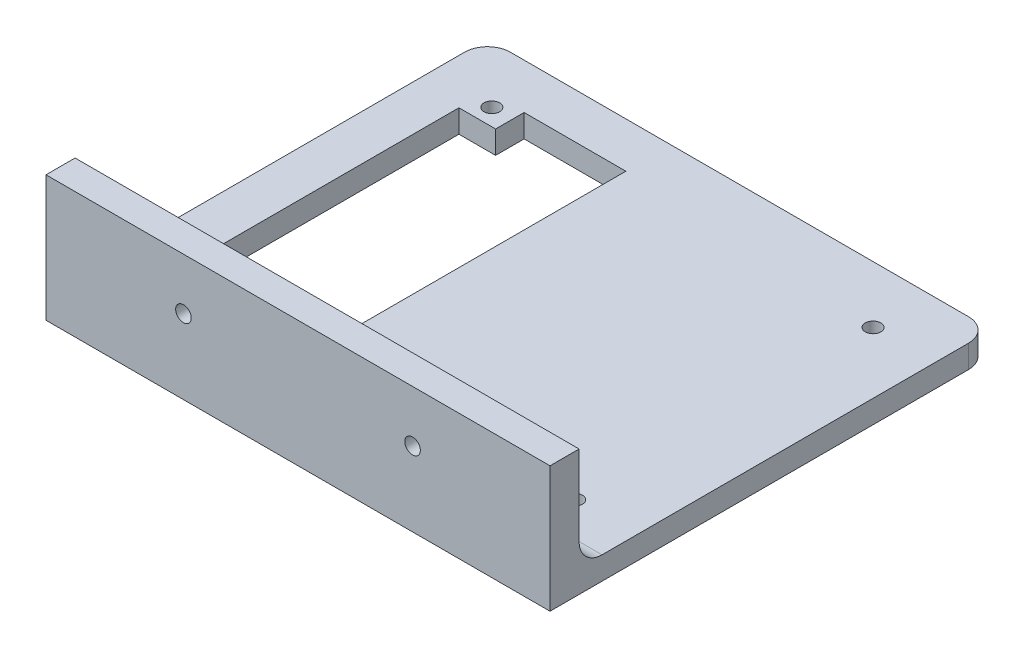
ISO-10303-21;
HEADER;
FILE_DESCRIPTION(('STEP AP214'),'2;1');
FILE_NAME('part.step','',(''),(''),'','','');
FILE_SCHEMA(('AUTOMOTIVE_DESIGN { 1 0 10303 214 1 1 1 1 }'));
ENDSEC;
DATA;
#1=APPLICATION_CONTEXT('core data for automotive mechanical design processes');
#2=APPLICATION_PROTOCOL_DEFINITION('international standard','automotive_design',2000,#1);
#3=PRODUCT_CONTEXT('',#1,'mechanical');
#4=PRODUCT('Part','Part','',(#3));
#5=PRODUCT_RELATED_PRODUCT_CATEGORY('part','',(#4));
#6=PRODUCT_DEFINITION_FORMATION('','',#4);
#7=PRODUCT_DEFINITION_CONTEXT('part definition',#1,'design');
#8=PRODUCT_DEFINITION('design','',#6,#7);
#9=PRODUCT_DEFINITION_SHAPE('','',#8);
#10=(LENGTH_UNIT() NAMED_UNIT(*) SI_UNIT(.MILLI.,.METRE.));
#11=(NAMED_UNIT(*) PLANE_ANGLE_UNIT() SI_UNIT($,.RADIAN.));
#12=(NAMED_UNIT(*) SI_UNIT($,.STERADIAN.) SOLID_ANGLE_UNIT());
#13=UNCERTAINTY_MEASURE_WITH_UNIT(LENGTH_MEASURE(1.E-05),#10,'distance_accuracy_value','');
#14=(GEOMETRIC_REPRESENTATION_CONTEXT(3) GLOBAL_UNCERTAINTY_ASSIGNED_CONTEXT((#13)) GLOBAL_UNIT_ASSIGNED_CONTEXT((#10,
#11,#12)) REPRESENTATION_CONTEXT('',''));
#15=CARTESIAN_POINT('',(0.,0.,0.));
#16=DIRECTION('',(0.,0.,1.));
#17=DIRECTION('',(1.,0.,0.));
#18=AXIS2_PLACEMENT_3D('',#15,#16,#17);
#19=CARTESIAN_POINT('',(0.,2.5,0.));
#20=DIRECTION('',(1.,0.,0.));
#21=DIRECTION('',(0.,0.,-1.));
#22=AXIS2_PLACEMENT_3D('',#19,#20,#21);
#23=PLANE('',#22);
#24=DIRECTION('',(0.,0.,1.));
#25=VECTOR('',#24,1.);
#26=CARTESIAN_POINT('',(0.,2.5,0.));
#27=LINE('',#26,#25);
#28=CARTESIAN_POINT('',(0.,2.5,5.));
#29=VERTEX_POINT('',#28);
#30=CARTESIAN_POINT('',(0.,2.5,85.));
#31=VERTEX_POINT('',#30);
#32=EDGE_CURVE('E296',#29,#31,#27,.T.);
#33=ORIENTED_EDGE('',*,*,#32,.F.);
#34=DIRECTION('',(0.,-1.,0.));
#35=VECTOR('',#34,1.);
#36=CARTESIAN_POINT('',(0.,2.5,5.));
#37=LINE('',#36,#35);
#38=CARTESIAN_POINT('',(0.,-2.5,5.));
#39=VERTEX_POINT('',#38);
#40=EDGE_CURVE('E327',#29,#39,#37,.T.);
#41=ORIENTED_EDGE('',*,*,#40,.T.);
#42=DIRECTION('',(0.,0.,1.));
#43=VECTOR('',#42,1.);
#44=CARTESIAN_POINT('',(0.,-2.5,0.));
#45=LINE('',#44,#43);
#46=CARTESIAN_POINT('',(0.,-2.5,96.35));
#47=VERTEX_POINT('',#46);
#48=EDGE_CURVE('E295',#39,#47,#45,.T.);
#49=ORIENTED_EDGE('',*,*,#48,.T.);
#50=DIRECTION('',(0.,1.,0.));
#51=VECTOR('',#50,1.);
#52=CARTESIAN_POINT('',(0.,-112.683131649087,96.35));
#53=LINE('',#52,#51);
#54=CARTESIAN_POINT('',(0.,25.,96.35));
#55=VERTEX_POINT('',#54);
#56=EDGE_CURVE('E260',#47,#55,#53,.T.);
#57=ORIENTED_EDGE('',*,*,#56,.T.);
#58=DIRECTION('',(0.,0.,1.));
#59=VECTOR('',#58,1.);
#60=CARTESIAN_POINT('',(0.,25.,90.));
#61=LINE('',#60,#59);
#62=CARTESIAN_POINT('',(0.,25.,90.));
#63=VERTEX_POINT('',#62);
#64=EDGE_CURVE('E248',#63,#55,#61,.T.);
#65=ORIENTED_EDGE('',*,*,#64,.F.);
#66=DIRECTION('',(0.,1.,0.));
#67=VECTOR('',#66,1.);
#68=CARTESIAN_POINT('',(0.,-112.683131649087,90.));
#69=LINE('',#68,#67);
#70=CARTESIAN_POINT('',(0.,7.50000000000001,90.));
#71=VERTEX_POINT('',#70);
#72=EDGE_CURVE('E261',#71,#63,#69,.T.);
#73=ORIENTED_EDGE('',*,*,#72,.F.);
#74=CARTESIAN_POINT('',(0.,7.5,85.));
#75=DIRECTION('',(1.,0.,0.));
#76=DIRECTION('',(0.,0.,-1.));
#77=AXIS2_PLACEMENT_3D('',#74,#75,#76);
#78=CIRCLE('',#77,5.);
#79=EDGE_CURVE('E11',#71,#31,#78,.T.);
#80=ORIENTED_EDGE('',*,*,#79,.T.);
#81=EDGE_LOOP('',(#33,#41,#49,#57,#65,#73,#80));
#82=FACE_BOUND('',#81,.T.);
#83=ADVANCED_FACE('F39',(#82),#23,.F.);
#84=CARTESIAN_POINT('',(110.,2.5,0.));
#85=DIRECTION('',(-1.,0.,0.));
#86=DIRECTION('',(0.,0.,1.));
#87=AXIS2_PLACEMENT_3D('',#84,#85,#86);
#88=PLANE('',#87);
#89=DIRECTION('',(0.,0.,-1.));
#90=VECTOR('',#89,1.);
#91=CARTESIAN_POINT('',(110.,-2.5,0.));
#92=LINE('',#91,#90);
#93=CARTESIAN_POINT('',(110.,-2.5,96.35));
#94=VERTEX_POINT('',#93);
#95=CARTESIAN_POINT('',(110.,-2.5,5.));
#96=VERTEX_POINT('',#95);
#97=EDGE_CURVE('E307',#94,#96,#92,.T.);
#98=ORIENTED_EDGE('',*,*,#97,.T.);
#99=DIRECTION('',(0.,-1.,0.));
#100=VECTOR('',#99,1.);
#101=CARTESIAN_POINT('',(110.,2.5,5.));
#102=LINE('',#101,#100);
#103=CARTESIAN_POINT('',(110.,2.5,5.));
#104=VERTEX_POINT('',#103);
#105=EDGE_CURVE('E320',#96,#104,#102,.F.);
#106=ORIENTED_EDGE('',*,*,#105,.T.);
#107=DIRECTION('',(0.,0.,-1.));
#108=VECTOR('',#107,1.);
#109=CARTESIAN_POINT('',(110.,2.5,0.));
#110=LINE('',#109,#108);
#111=CARTESIAN_POINT('',(110.,2.5,85.));
#112=VERTEX_POINT('',#111);
#113=EDGE_CURVE('E299',#112,#104,#110,.T.);
#114=ORIENTED_EDGE('',*,*,#113,.F.);
#115=CARTESIAN_POINT('',(110.,7.5,85.));
#116=DIRECTION('',(-1.,0.,0.));
#117=DIRECTION('',(0.,0.,1.));
#118=AXIS2_PLACEMENT_3D('',#115,#116,#117);
#119=CIRCLE('',#118,5.);
#120=CARTESIAN_POINT('',(110.,7.50000000000001,90.));
#121=VERTEX_POINT('',#120);
#122=EDGE_CURVE('E47',#112,#121,#119,.T.);
#123=ORIENTED_EDGE('',*,*,#122,.T.);
#124=DIRECTION('',(0.,1.,0.));
#125=VECTOR('',#124,1.);
#126=CARTESIAN_POINT('',(110.,-112.683131649087,90.));
#127=LINE('',#126,#125);
#128=CARTESIAN_POINT('',(110.,25.,90.));
#129=VERTEX_POINT('',#128);
#130=EDGE_CURVE('E264',#121,#129,#127,.T.);
#131=ORIENTED_EDGE('',*,*,#130,.T.);
#132=DIRECTION('',(0.,0.,-1.));
#133=VECTOR('',#132,1.);
#134=CARTESIAN_POINT('',(110.,25.,90.));
#135=LINE('',#134,#133);
#136=CARTESIAN_POINT('',(110.,25.,96.35));
#137=VERTEX_POINT('',#136);
#138=EDGE_CURVE('E254',#137,#129,#135,.T.);
#139=ORIENTED_EDGE('',*,*,#138,.F.);
#140=DIRECTION('',(0.,1.,0.));
#141=VECTOR('',#140,1.);
#142=CARTESIAN_POINT('',(110.,-112.683131649087,96.35));
#143=LINE('',#142,#141);
#144=EDGE_CURVE('E266',#94,#137,#143,.T.);
#145=ORIENTED_EDGE('',*,*,#144,.F.);
#146=EDGE_LOOP('',(#98,#106,#114,#123,#131,#139,#145));
#147=FACE_BOUND('',#146,.T.);
#148=ADVANCED_FACE('F339',(#147),#88,.F.);
#149=CARTESIAN_POINT('',(0.,2.5,0.));
#150=DIRECTION('',(0.,0.,1.));
#151=DIRECTION('',(1.,0.,0.));
#152=AXIS2_PLACEMENT_3D('',#149,#150,#151);
#153=PLANE('',#152);
#154=DIRECTION('',(-1.,0.,0.));
#155=VECTOR('',#154,1.);
#156=CARTESIAN_POINT('',(0.,2.5,0.));
#157=LINE('',#156,#155);
#158=CARTESIAN_POINT('',(105.,2.5,0.));
#159=VERTEX_POINT('',#158);
#160=CARTESIAN_POINT('',(5.,2.5,0.));
#161=VERTEX_POINT('',#160);
#162=EDGE_CURVE('E302',#159,#161,#157,.T.);
#163=ORIENTED_EDGE('',*,*,#162,.F.);
#164=DIRECTION('',(0.,-1.,0.));
#165=VECTOR('',#164,1.);
#166=CARTESIAN_POINT('',(105.,2.5,0.));
#167=LINE('',#166,#165);
#168=CARTESIAN_POINT('',(105.,-2.5,0.));
#169=VERTEX_POINT('',#168);
#170=EDGE_CURVE('E313',#159,#169,#167,.T.);
#171=ORIENTED_EDGE('',*,*,#170,.T.);
#172=DIRECTION('',(-1.,0.,0.));
#173=VECTOR('',#172,1.);
#174=CARTESIAN_POINT('',(0.,-2.5,0.));
#175=LINE('',#174,#173);
#176=CARTESIAN_POINT('',(5.,-2.5,0.));
#177=VERTEX_POINT('',#176);
#178=EDGE_CURVE('E300',#169,#177,#175,.T.);
#179=ORIENTED_EDGE('',*,*,#178,.T.);
#180=DIRECTION('',(0.,-1.,0.));
#181=VECTOR('',#180,1.);
#182=CARTESIAN_POINT('',(5.,2.5,0.));
#183=LINE('',#182,#181);
#184=EDGE_CURVE('E305',#177,#161,#183,.F.);
#185=ORIENTED_EDGE('',*,*,#184,.T.);
#186=EDGE_LOOP('',(#163,#171,#179,#185));
#187=FACE_BOUND('',#186,.T.);
#188=ADVANCED_FACE('F349',(#187),#153,.F.);
#189=CARTESIAN_POINT('',(0.,2.5,0.));
#190=DIRECTION('',(0.,1.,0.));
#191=DIRECTION('',(0.,0.,1.));
#192=AXIS2_PLACEMENT_3D('',#189,#190,#191);
#193=PLANE('',#192);
#194=DIRECTION('',(-1.,0.,0.));
#195=VECTOR('',#194,1.);
#196=CARTESIAN_POINT('',(17.9,2.5,9.90000000000001));
#197=LINE('',#196,#195);
#198=CARTESIAN_POINT('',(40.1,2.5,9.90000000000001));
#199=VERTEX_POINT('',#198);
#200=CARTESIAN_POINT('',(17.9,2.5,9.90000000000001));
#201=VERTEX_POINT('',#200);
#202=EDGE_CURVE('E174',#199,#201,#197,.T.);
#203=ORIENTED_EDGE('',*,*,#202,.F.);
#204=DIRECTION('',(0.,0.,1.));
#205=VECTOR('',#204,1.);
#206=CARTESIAN_POINT('',(40.1,2.5,9.90000000000001));
#207=LINE('',#206,#205);
#208=CARTESIAN_POINT('',(40.1,2.5,80.1));
#209=VERTEX_POINT('',#208);
#210=EDGE_CURVE('E657',#199,#209,#207,.T.);
#211=ORIENTED_EDGE('',*,*,#210,.T.);
#212=DIRECTION('',(1.,0.,0.));
#213=VECTOR('',#212,1.);
#214=CARTESIAN_POINT('',(92.1,2.5,80.1));
#215=LINE('',#214,#213);
#216=CARTESIAN_POINT('',(17.9,2.5,80.1));
#217=VERTEX_POINT('',#216);
#218=EDGE_CURVE('E168',#217,#209,#215,.T.);
#219=ORIENTED_EDGE('',*,*,#218,.F.);
#220=DIRECTION('',(0.,0.,1.));
#221=VECTOR('',#220,1.);
#222=CARTESIAN_POINT('',(17.9,2.5,80.1));
#223=LINE('',#222,#221);
#224=CARTESIAN_POINT('',(17.9,2.5,73.8738359201774));
#225=VERTEX_POINT('',#224);
#226=EDGE_CURVE('E211',#225,#217,#223,.T.);
#227=ORIENTED_EDGE('',*,*,#226,.F.);
#228=DIRECTION('',(1.,0.,0.));
#229=VECTOR('',#228,1.);
#230=CARTESIAN_POINT('',(17.9,2.5,73.8738359201774));
#231=LINE('',#230,#229);
#232=CARTESIAN_POINT('',(9.90000000000001,2.5,73.8738359201774));
#233=VERTEX_POINT('',#232);
#234=EDGE_CURVE('E208',#233,#225,#231,.T.);
#235=ORIENTED_EDGE('',*,*,#234,.F.);
#236=DIRECTION('',(0.,0.,1.));
#237=VECTOR('',#236,1.);
#238=CARTESIAN_POINT('',(9.90000000000001,2.5,73.8738359201774));
#239=LINE('',#238,#237);
#240=CARTESIAN_POINT('',(9.89999999999999,2.5,16.1261640798226));
#241=VERTEX_POINT('',#240);
#242=EDGE_CURVE('E205',#241,#233,#239,.T.);
#243=ORIENTED_EDGE('',*,*,#242,.F.);
#244=DIRECTION('',(-1.,0.,0.));
#245=VECTOR('',#244,1.);
#246=CARTESIAN_POINT('',(9.89999999999999,2.5,16.1261640798226));
#247=LINE('',#246,#245);
#248=CARTESIAN_POINT('',(17.9,2.5,16.1261640798226));
#249=VERTEX_POINT('',#248);
#250=EDGE_CURVE('E202',#249,#241,#247,.T.);
#251=ORIENTED_EDGE('',*,*,#250,.F.);
#252=DIRECTION('',(0.,0.,1.));
#253=VECTOR('',#252,1.);
#254=CARTESIAN_POINT('',(17.9,2.5,16.1261640798226));
#255=LINE('',#254,#253);
#256=EDGE_CURVE('E199',#201,#249,#255,.T.);
#257=ORIENTED_EDGE('',*,*,#256,.F.);
#258=EDGE_LOOP('',(#203,#211,#219,#227,#235,#243,#251,#257));
#259=FACE_BOUND('',#258,.T.);
#260=CARTESIAN_POINT('',(96.6,2.5,12.44245));
#261=DIRECTION('',(0.,1.,0.));
#262=DIRECTION('',(0.,0.,1.));
#263=AXIS2_PLACEMENT_3D('',#260,#261,#262);
#264=CIRCLE('',#263,1.69999999999999);
#265=CARTESIAN_POINT('',(96.6,2.5,14.14245));
#266=VERTEX_POINT('',#265);
#267=EDGE_CURVE('E271',#266,#266,#264,.T.);
#268=ORIENTED_EDGE('',*,*,#267,.F.);
#269=EDGE_LOOP('',(#268));
#270=FACE_BOUND('',#269,.T.);
#271=CARTESIAN_POINT('',(96.6,2.5,77.55755));
#272=DIRECTION('',(0.,1.,0.));
#273=DIRECTION('',(0.,0.,1.));
#274=AXIS2_PLACEMENT_3D('',#271,#272,#273);
#275=CIRCLE('',#274,1.69999999999999);
#276=CARTESIAN_POINT('',(96.6,2.5,79.25755));
#277=VERTEX_POINT('',#276);
#278=EDGE_CURVE('E277',#277,#277,#275,.T.);
#279=ORIENTED_EDGE('',*,*,#278,.F.);
#280=EDGE_LOOP('',(#279));
#281=FACE_BOUND('',#280,.T.);
#282=CARTESIAN_POINT('',(13.4,2.5,12.44245));
#283=DIRECTION('',(0.,1.,0.));
#284=DIRECTION('',(0.,0.,1.));
#285=AXIS2_PLACEMENT_3D('',#282,#283,#284);
#286=CIRCLE('',#285,1.7);
#287=CARTESIAN_POINT('',(13.4,2.5,14.14245));
#288=VERTEX_POINT('',#287);
#289=EDGE_CURVE('E283',#288,#288,#286,.T.);
#290=ORIENTED_EDGE('',*,*,#289,.F.);
#291=EDGE_LOOP('',(#290));
#292=FACE_BOUND('',#291,.T.);
#293=CARTESIAN_POINT('',(13.4,2.5,77.55755));
#294=DIRECTION('',(0.,1.,0.));
#295=DIRECTION('',(0.,0.,1.));
#296=AXIS2_PLACEMENT_3D('',#293,#294,#295);
#297=CIRCLE('',#296,1.7);
#298=CARTESIAN_POINT('',(13.4,2.5,79.25755));
#299=VERTEX_POINT('',#298);
#300=EDGE_CURVE('E289',#299,#299,#297,.T.);
#301=ORIENTED_EDGE('',*,*,#300,.F.);
#302=EDGE_LOOP('',(#301));
#303=FACE_BOUND('',#302,.T.);
#304=ORIENTED_EDGE('',*,*,#32,.T.);
#305=DIRECTION('',(1.,0.,0.));
#306=VECTOR('',#305,1.);
#307=CARTESIAN_POINT('',(110.,2.5,85.));
#308=LINE('',#307,#306);
#309=EDGE_CURVE('E330',#31,#112,#308,.T.);
#310=ORIENTED_EDGE('',*,*,#309,.T.);
#311=ORIENTED_EDGE('',*,*,#113,.T.);
#312=CARTESIAN_POINT('',(105.,2.5,5.));
#313=DIRECTION('',(0.,1.,0.));
#314=DIRECTION('',(0.,0.,1.));
#315=AXIS2_PLACEMENT_3D('',#312,#313,#314);
#316=CIRCLE('',#315,5.);
#317=EDGE_CURVE('E325',#104,#159,#316,.T.);
#318=ORIENTED_EDGE('',*,*,#317,.T.);
#319=ORIENTED_EDGE('',*,*,#162,.T.);
#320=CARTESIAN_POINT('',(5.,2.5,5.));
#321=DIRECTION('',(0.,1.,0.));
#322=DIRECTION('',(0.,0.,1.));
#323=AXIS2_PLACEMENT_3D('',#320,#321,#322);
#324=CIRCLE('',#323,5.);
#325=EDGE_CURVE('E323',#161,#29,#324,.T.);
#326=ORIENTED_EDGE('',*,*,#325,.T.);
#327=EDGE_LOOP('',(#304,#310,#311,#318,#319,#326));
#328=FACE_BOUND('',#327,.T.);
#329=ADVANCED_FACE('F335',(#259,#270,#281,#292,#303,#328),#193,.T.);
#330=CARTESIAN_POINT('',(0.,-2.5,0.));
#331=DIRECTION('',(0.,1.,0.));
#332=DIRECTION('',(0.,0.,1.));
#333=AXIS2_PLACEMENT_3D('',#330,#331,#332);
#334=PLANE('',#333);
#335=DIRECTION('',(0.,0.,1.));
#336=VECTOR('',#335,1.);
#337=CARTESIAN_POINT('',(40.1,-2.5,9.90000000000001));
#338=LINE('',#337,#336);
#339=CARTESIAN_POINT('',(40.1,-2.5,9.90000000000001));
#340=VERTEX_POINT('',#339);
#341=CARTESIAN_POINT('',(40.1,-2.5,80.1));
#342=VERTEX_POINT('',#341);
#343=EDGE_CURVE('E165',#340,#342,#338,.T.);
#344=ORIENTED_EDGE('',*,*,#343,.F.);
#345=DIRECTION('',(-1.,0.,0.));
#346=VECTOR('',#345,1.);
#347=CARTESIAN_POINT('',(17.9,-2.5,9.90000000000001));
#348=LINE('',#347,#346);
#349=CARTESIAN_POINT('',(17.9,-2.5,9.90000000000001));
#350=VERTEX_POINT('',#349);
#351=EDGE_CURVE('E156',#340,#350,#348,.T.);
#352=ORIENTED_EDGE('',*,*,#351,.T.);
#353=DIRECTION('',(0.,0.,1.));
#354=VECTOR('',#353,1.);
#355=CARTESIAN_POINT('',(17.9,-2.5,16.1261640798226));
#356=LINE('',#355,#354);
#357=CARTESIAN_POINT('',(17.9,-2.5,16.1261640798226));
#358=VERTEX_POINT('',#357);
#359=EDGE_CURVE('E162',#350,#358,#356,.T.);
#360=ORIENTED_EDGE('',*,*,#359,.T.);
#361=DIRECTION('',(-1.,0.,0.));
#362=VECTOR('',#361,1.);
#363=CARTESIAN_POINT('',(9.89999999999999,-2.5,16.1261640798226));
#364=LINE('',#363,#362);
#365=CARTESIAN_POINT('',(9.89999999999999,-2.5,16.1261640798226));
#366=VERTEX_POINT('',#365);
#367=EDGE_CURVE('E183',#358,#366,#364,.T.);
#368=ORIENTED_EDGE('',*,*,#367,.T.);
#369=DIRECTION('',(0.,0.,1.));
#370=VECTOR('',#369,1.);
#371=CARTESIAN_POINT('',(9.90000000000001,-2.5,73.8738359201774));
#372=LINE('',#371,#370);
#373=CARTESIAN_POINT('',(9.90000000000001,-2.5,73.8738359201774));
#374=VERTEX_POINT('',#373);
#375=EDGE_CURVE('E185',#366,#374,#372,.T.);
#376=ORIENTED_EDGE('',*,*,#375,.T.);
#377=DIRECTION('',(1.,0.,0.));
#378=VECTOR('',#377,1.);
#379=CARTESIAN_POINT('',(17.9,-2.5,73.8738359201774));
#380=LINE('',#379,#378);
#381=CARTESIAN_POINT('',(17.9,-2.5,73.8738359201774));
#382=VERTEX_POINT('',#381);
#383=EDGE_CURVE('E191',#374,#382,#380,.T.);
#384=ORIENTED_EDGE('',*,*,#383,.T.);
#385=DIRECTION('',(0.,0.,1.));
#386=VECTOR('',#385,1.);
#387=CARTESIAN_POINT('',(17.9,-2.5,80.1));
#388=LINE('',#387,#386);
#389=CARTESIAN_POINT('',(17.9,-2.5,80.1));
#390=VERTEX_POINT('',#389);
#391=EDGE_CURVE('E194',#382,#390,#388,.T.);
#392=ORIENTED_EDGE('',*,*,#391,.T.);
#393=DIRECTION('',(1.,0.,0.));
#394=VECTOR('',#393,1.);
#395=CARTESIAN_POINT('',(92.1,-2.5,80.1));
#396=LINE('',#395,#394);
#397=EDGE_CURVE('E179',#390,#342,#396,.T.);
#398=ORIENTED_EDGE('',*,*,#397,.T.);
#399=EDGE_LOOP('',(#344,#352,#360,#368,#376,#384,#392,#398));
#400=FACE_BOUND('',#399,.T.);
#401=CARTESIAN_POINT('',(96.6,-2.5,12.44245));
#402=DIRECTION('',(0.,1.,0.));
#403=DIRECTION('',(0.,0.,1.));
#404=AXIS2_PLACEMENT_3D('',#401,#402,#403);
#405=CIRCLE('',#404,1.69999999999999);
#406=CARTESIAN_POINT('',(96.6,-2.5,14.14245));
#407=VERTEX_POINT('',#406);
#408=EDGE_CURVE('E274',#407,#407,#405,.T.);
#409=ORIENTED_EDGE('',*,*,#408,.T.);
#410=EDGE_LOOP('',(#409));
#411=FACE_BOUND('',#410,.T.);
#412=CARTESIAN_POINT('',(96.6,-2.5,77.55755));
#413=DIRECTION('',(0.,1.,0.));
#414=DIRECTION('',(0.,0.,1.));
#415=AXIS2_PLACEMENT_3D('',#412,#413,#414);
#416=CIRCLE('',#415,1.69999999999999);
#417=CARTESIAN_POINT('',(96.6,-2.5,79.25755));
#418=VERTEX_POINT('',#417);
#419=EDGE_CURVE('E280',#418,#418,#416,.T.);
#420=ORIENTED_EDGE('',*,*,#419,.T.);
#421=EDGE_LOOP('',(#420));
#422=FACE_BOUND('',#421,.T.);
#423=CARTESIAN_POINT('',(13.4,-2.5,12.44245));
#424=DIRECTION('',(0.,1.,0.));
#425=DIRECTION('',(0.,0.,1.));
#426=AXIS2_PLACEMENT_3D('',#423,#424,#425);
#427=CIRCLE('',#426,1.7);
#428=CARTESIAN_POINT('',(13.4,-2.5,14.14245));
#429=VERTEX_POINT('',#428);
#430=EDGE_CURVE('E286',#429,#429,#427,.T.);
#431=ORIENTED_EDGE('',*,*,#430,.T.);
#432=EDGE_LOOP('',(#431));
#433=FACE_BOUND('',#432,.T.);
#434=CARTESIAN_POINT('',(13.4,-2.5,77.55755));
#435=DIRECTION('',(0.,1.,0.));
#436=DIRECTION('',(0.,0.,1.));
#437=AXIS2_PLACEMENT_3D('',#434,#435,#436);
#438=CIRCLE('',#437,1.7);
#439=CARTESIAN_POINT('',(13.4,-2.5,79.25755));
#440=VERTEX_POINT('',#439);
#441=EDGE_CURVE('E292',#440,#440,#438,.T.);
#442=ORIENTED_EDGE('',*,*,#441,.T.);
#443=EDGE_LOOP('',(#442));
#444=FACE_BOUND('',#443,.T.);
#445=ORIENTED_EDGE('',*,*,#178,.F.);
#446=CARTESIAN_POINT('',(105.,-2.5,5.));
#447=DIRECTION('',(0.,1.,0.));
#448=DIRECTION('',(0.,0.,1.));
#449=AXIS2_PLACEMENT_3D('',#446,#447,#448);
#450=CIRCLE('',#449,5.);
#451=EDGE_CURVE('E318',#169,#96,#450,.F.);
#452=ORIENTED_EDGE('',*,*,#451,.T.);
#453=ORIENTED_EDGE('',*,*,#97,.F.);
#454=DIRECTION('',(-1.,0.,0.));
#455=VECTOR('',#454,1.);
#456=CARTESIAN_POINT('',(0.,-2.5,96.35));
#457=LINE('',#456,#455);
#458=EDGE_CURVE('E263',#94,#47,#457,.T.);
#459=ORIENTED_EDGE('',*,*,#458,.T.);
#460=ORIENTED_EDGE('',*,*,#48,.F.);
#461=CARTESIAN_POINT('',(5.,-2.5,5.));
#462=DIRECTION('',(0.,1.,0.));
#463=DIRECTION('',(0.,0.,1.));
#464=AXIS2_PLACEMENT_3D('',#461,#462,#463);
#465=CIRCLE('',#464,5.);
#466=EDGE_CURVE('E316',#39,#177,#465,.F.);
#467=ORIENTED_EDGE('',*,*,#466,.T.);
#468=EDGE_LOOP('',(#445,#452,#453,#459,#460,#467));
#469=FACE_BOUND('',#468,.T.);
#470=ADVANCED_FACE('F158',(#400,#411,#422,#433,#444,#469),#334,.F.);
#471=CARTESIAN_POINT('',(13.4,2.5,77.55755));
#472=DIRECTION('',(0.,1.,0.));
#473=DIRECTION('',(0.,0.,1.));
#474=AXIS2_PLACEMENT_3D('',#471,#472,#473);
#475=CYLINDRICAL_SURFACE('',#474,1.7);
#476=ORIENTED_EDGE('',*,*,#441,.F.);
#477=EDGE_LOOP('',(#476));
#478=FACE_BOUND('',#477,.T.);
#479=ORIENTED_EDGE('',*,*,#300,.T.);
#480=EDGE_LOOP('',(#479));
#481=FACE_BOUND('',#480,.T.);
#482=ADVANCED_FACE('F454',(#478,#481),#475,.F.);
#483=CARTESIAN_POINT('',(13.4,2.5,12.44245));
#484=DIRECTION('',(0.,1.,0.));
#485=DIRECTION('',(0.,0.,1.));
#486=AXIS2_PLACEMENT_3D('',#483,#484,#485);
#487=CYLINDRICAL_SURFACE('',#486,1.7);
#488=ORIENTED_EDGE('',*,*,#430,.F.);
#489=EDGE_LOOP('',(#488));
#490=FACE_BOUND('',#489,.T.);
#491=ORIENTED_EDGE('',*,*,#289,.T.);
#492=EDGE_LOOP('',(#491));
#493=FACE_BOUND('',#492,.T.);
#494=ADVANCED_FACE('F450',(#490,#493),#487,.F.);
#495=CARTESIAN_POINT('',(96.6,2.5,77.55755));
#496=DIRECTION('',(0.,1.,0.));
#497=DIRECTION('',(0.,0.,1.));
#498=AXIS2_PLACEMENT_3D('',#495,#496,#497);
#499=CYLINDRICAL_SURFACE('',#498,1.69999999999999);
#500=ORIENTED_EDGE('',*,*,#419,.F.);
#501=EDGE_LOOP('',(#500));
#502=FACE_BOUND('',#501,.T.);
#503=ORIENTED_EDGE('',*,*,#278,.T.);
#504=EDGE_LOOP('',(#503));
#505=FACE_BOUND('',#504,.T.);
#506=ADVANCED_FACE('F446',(#502,#505),#499,.F.);
#507=CARTESIAN_POINT('',(96.6,2.5,12.44245));
#508=DIRECTION('',(0.,1.,0.));
#509=DIRECTION('',(0.,0.,1.));
#510=AXIS2_PLACEMENT_3D('',#507,#508,#509);
#511=CYLINDRICAL_SURFACE('',#510,1.69999999999999);
#512=ORIENTED_EDGE('',*,*,#408,.F.);
#513=EDGE_LOOP('',(#512));
#514=FACE_BOUND('',#513,.T.);
#515=ORIENTED_EDGE('',*,*,#267,.T.);
#516=EDGE_LOOP('',(#515));
#517=FACE_BOUND('',#516,.T.);
#518=ADVANCED_FACE('F439',(#514,#517),#511,.F.);
#519=CARTESIAN_POINT('',(0.,-112.683131649087,90.));
#520=DIRECTION('',(0.,0.,-1.));
#521=DIRECTION('',(-1.,0.,0.));
#522=AXIS2_PLACEMENT_3D('',#519,#520,#521);
#523=PLANE('',#522);
#524=CARTESIAN_POINT('',(30.,13.75,90.));
#525=DIRECTION('',(0.,0.,-1.));
#526=DIRECTION('',(-1.,0.,0.));
#527=AXIS2_PLACEMENT_3D('',#524,#525,#526);
#528=CIRCLE('',#527,3.25);
#529=CARTESIAN_POINT('',(26.75,13.75,90.));
#530=VERTEX_POINT('',#529);
#531=EDGE_CURVE('E217',#530,#530,#528,.T.);
#532=ORIENTED_EDGE('',*,*,#531,.F.);
#533=EDGE_LOOP('',(#532));
#534=FACE_BOUND('',#533,.T.);
#535=CARTESIAN_POINT('',(80.,13.75,90.));
#536=DIRECTION('',(0.,0.,-1.));
#537=DIRECTION('',(-1.,0.,0.));
#538=AXIS2_PLACEMENT_3D('',#535,#536,#537);
#539=CIRCLE('',#538,3.25);
#540=CARTESIAN_POINT('',(76.75,13.75,90.));
#541=VERTEX_POINT('',#540);
#542=EDGE_CURVE('E236',#541,#541,#539,.T.);
#543=ORIENTED_EDGE('',*,*,#542,.F.);
#544=EDGE_LOOP('',(#543));
#545=FACE_BOUND('',#544,.T.);
#546=ORIENTED_EDGE('',*,*,#130,.F.);
#547=DIRECTION('',(1.,0.,0.));
#548=VECTOR('',#547,1.);
#549=CARTESIAN_POINT('',(0.,7.5,90.));
#550=LINE('',#549,#548);
#551=EDGE_CURVE('E60',#121,#71,#550,.F.);
#552=ORIENTED_EDGE('',*,*,#551,.T.);
#553=ORIENTED_EDGE('',*,*,#72,.T.);
#554=DIRECTION('',(-1.,0.,0.));
#555=VECTOR('',#554,1.);
#556=CARTESIAN_POINT('',(0.,25.,90.));
#557=LINE('',#556,#555);
#558=EDGE_CURVE('E257',#129,#63,#557,.T.);
#559=ORIENTED_EDGE('',*,*,#558,.F.);
#560=EDGE_LOOP('',(#546,#552,#553,#559));
#561=FACE_BOUND('',#560,.T.);
#562=ADVANCED_FACE('F437',(#534,#545,#561),#523,.T.);
#563=CARTESIAN_POINT('',(0.,-112.683131649087,96.35));
#564=DIRECTION('',(0.,0.,1.));
#565=DIRECTION('',(1.,0.,0.));
#566=AXIS2_PLACEMENT_3D('',#563,#564,#565);
#567=PLANE('',#566);
#568=CARTESIAN_POINT('',(30.,13.75,96.35));
#569=DIRECTION('',(0.,0.,1.));
#570=DIRECTION('',(1.,0.,0.));
#571=AXIS2_PLACEMENT_3D('',#568,#569,#570);
#572=CIRCLE('',#571,1.7);
#573=CARTESIAN_POINT('',(31.7,13.75,96.35));
#574=VERTEX_POINT('',#573);
#575=EDGE_CURVE('E233',#574,#574,#572,.T.);
#576=ORIENTED_EDGE('',*,*,#575,.F.);
#577=EDGE_LOOP('',(#576));
#578=FACE_BOUND('',#577,.T.);
#579=CARTESIAN_POINT('',(80.,13.75,96.35));
#580=DIRECTION('',(0.,0.,1.));
#581=DIRECTION('',(1.,0.,0.));
#582=AXIS2_PLACEMENT_3D('',#579,#580,#581);
#583=CIRCLE('',#582,1.69999999999999);
#584=CARTESIAN_POINT('',(81.7,13.75,96.35));
#585=VERTEX_POINT('',#584);
#586=EDGE_CURVE('E245',#585,#585,#583,.T.);
#587=ORIENTED_EDGE('',*,*,#586,.F.);
#588=EDGE_LOOP('',(#587));
#589=FACE_BOUND('',#588,.T.);
#590=ORIENTED_EDGE('',*,*,#458,.F.);
#591=ORIENTED_EDGE('',*,*,#144,.T.);
#592=DIRECTION('',(1.,0.,0.));
#593=VECTOR('',#592,1.);
#594=CARTESIAN_POINT('',(0.,25.,96.35));
#595=LINE('',#594,#593);
#596=EDGE_CURVE('E251',#55,#137,#595,.T.);
#597=ORIENTED_EDGE('',*,*,#596,.F.);
#598=ORIENTED_EDGE('',*,*,#56,.F.);
#599=EDGE_LOOP('',(#590,#591,#597,#598));
#600=FACE_BOUND('',#599,.T.);
#601=ADVANCED_FACE('F435',(#578,#589,#600),#567,.T.);
#602=CARTESIAN_POINT('',(0.,25.,0.));
#603=DIRECTION('',(0.,1.,0.));
#604=DIRECTION('',(0.,0.,1.));
#605=AXIS2_PLACEMENT_3D('',#602,#603,#604);
#606=PLANE('',#605);
#607=ORIENTED_EDGE('',*,*,#64,.T.);
#608=ORIENTED_EDGE('',*,*,#596,.T.);
#609=ORIENTED_EDGE('',*,*,#138,.T.);
#610=ORIENTED_EDGE('',*,*,#558,.T.);
#611=EDGE_LOOP('',(#607,#608,#609,#610));
#612=FACE_BOUND('',#611,.T.);
#613=ADVANCED_FACE('F431',(#612),#606,.T.);
#614=CARTESIAN_POINT('',(80.,13.75,90.));
#615=DIRECTION('',(0.,0.,-1.));
#616=DIRECTION('',(-1.,0.,0.));
#617=AXIS2_PLACEMENT_3D('',#614,#615,#616);
#618=CYLINDRICAL_SURFACE('',#617,1.69999999999999);
#619=CARTESIAN_POINT('',(80.,13.75,93.));
#620=DIRECTION('',(0.,0.,-1.));
#621=DIRECTION('',(-1.,0.,0.));
#622=AXIS2_PLACEMENT_3D('',#619,#620,#621);
#623=CIRCLE('',#622,1.69999999999999);
#624=CARTESIAN_POINT('',(78.3,13.75,93.));
#625=VERTEX_POINT('',#624);
#626=EDGE_CURVE('E242',#625,#625,#623,.T.);
#627=ORIENTED_EDGE('',*,*,#626,.T.);
#628=EDGE_LOOP('',(#627));
#629=FACE_BOUND('',#628,.T.);
#630=ORIENTED_EDGE('',*,*,#586,.T.);
#631=EDGE_LOOP('',(#630));
#632=FACE_BOUND('',#631,.T.);
#633=ADVANCED_FACE('F427',(#629,#632),#618,.F.);
#634=CARTESIAN_POINT('',(81.7,13.75,93.));
#635=DIRECTION('',(0.,0.,1.));
#636=DIRECTION('',(1.,0.,0.));
#637=AXIS2_PLACEMENT_3D('',#634,#635,#636);
#638=PLANE('',#637);
#639=ORIENTED_EDGE('',*,*,#626,.F.);
#640=EDGE_LOOP('',(#639));
#641=FACE_BOUND('',#640,.T.);
#642=CARTESIAN_POINT('',(80.,13.75,93.));
#643=DIRECTION('',(0.,0.,-1.));
#644=DIRECTION('',(-1.,0.,0.));
#645=AXIS2_PLACEMENT_3D('',#642,#643,#644);
#646=CIRCLE('',#645,3.25);
#647=CARTESIAN_POINT('',(76.75,13.75,93.));
#648=VERTEX_POINT('',#647);
#649=EDGE_CURVE('E239',#648,#648,#646,.T.);
#650=ORIENTED_EDGE('',*,*,#649,.T.);
#651=EDGE_LOOP('',(#650));
#652=FACE_BOUND('',#651,.T.);
#653=ADVANCED_FACE('F423',(#641,#652),#638,.F.);
#654=CARTESIAN_POINT('',(80.,13.75,90.));
#655=DIRECTION('',(0.,0.,-1.));
#656=DIRECTION('',(-1.,0.,0.));
#657=AXIS2_PLACEMENT_3D('',#654,#655,#656);
#658=CYLINDRICAL_SURFACE('',#657,3.25);
#659=ORIENTED_EDGE('',*,*,#649,.F.);
#660=EDGE_LOOP('',(#659));
#661=FACE_BOUND('',#660,.T.);
#662=ORIENTED_EDGE('',*,*,#542,.T.);
#663=EDGE_LOOP('',(#662));
#664=FACE_BOUND('',#663,.T.);
#665=ADVANCED_FACE('F419',(#661,#664),#658,.F.);
#666=CARTESIAN_POINT('',(30.,13.75,90.));
#667=DIRECTION('',(0.,0.,-1.));
#668=DIRECTION('',(-1.,0.,0.));
#669=AXIS2_PLACEMENT_3D('',#666,#667,#668);
#670=CYLINDRICAL_SURFACE('',#669,1.7);
#671=CARTESIAN_POINT('',(30.,13.75,93.));
#672=DIRECTION('',(0.,0.,-1.));
#673=DIRECTION('',(-1.,0.,0.));
#674=AXIS2_PLACEMENT_3D('',#671,#672,#673);
#675=CIRCLE('',#674,1.7);
#676=CARTESIAN_POINT('',(28.3,13.75,93.));
#677=VERTEX_POINT('',#676);
#678=EDGE_CURVE('E230',#677,#677,#675,.T.);
#679=ORIENTED_EDGE('',*,*,#678,.T.);
#680=EDGE_LOOP('',(#679));
#681=FACE_BOUND('',#680,.T.);
#682=ORIENTED_EDGE('',*,*,#575,.T.);
#683=EDGE_LOOP('',(#682));
#684=FACE_BOUND('',#683,.T.);
#685=ADVANCED_FACE('F415',(#681,#684),#670,.F.);
#686=CARTESIAN_POINT('',(31.7,13.75,93.));
#687=DIRECTION('',(0.,0.,1.));
#688=DIRECTION('',(1.,0.,0.));
#689=AXIS2_PLACEMENT_3D('',#686,#687,#688);
#690=PLANE('',#689);
#691=ORIENTED_EDGE('',*,*,#678,.F.);
#692=EDGE_LOOP('',(#691));
#693=FACE_BOUND('',#692,.T.);
#694=CARTESIAN_POINT('',(30.,13.75,93.));
#695=DIRECTION('',(0.,0.,-1.));
#696=DIRECTION('',(-1.,0.,0.));
#697=AXIS2_PLACEMENT_3D('',#694,#695,#696);
#698=CIRCLE('',#697,3.25);
#699=CARTESIAN_POINT('',(26.75,13.75,93.));
#700=VERTEX_POINT('',#699);
#701=EDGE_CURVE('E227',#700,#700,#698,.T.);
#702=ORIENTED_EDGE('',*,*,#701,.T.);
#703=EDGE_LOOP('',(#702));
#704=FACE_BOUND('',#703,.T.);
#705=ADVANCED_FACE('F411',(#693,#704),#690,.F.);
#706=CARTESIAN_POINT('',(30.,13.75,90.));
#707=DIRECTION('',(0.,0.,-1.));
#708=DIRECTION('',(-1.,0.,0.));
#709=AXIS2_PLACEMENT_3D('',#706,#707,#708);
#710=CYLINDRICAL_SURFACE('',#709,3.25);
#711=ORIENTED_EDGE('',*,*,#701,.F.);
#712=EDGE_LOOP('',(#711));
#713=FACE_BOUND('',#712,.T.);
#714=ORIENTED_EDGE('',*,*,#531,.T.);
#715=EDGE_LOOP('',(#714));
#716=FACE_BOUND('',#715,.T.);
#717=ADVANCED_FACE('F390',(#713,#716),#710,.F.);
#718=CARTESIAN_POINT('',(92.1,-2.5,80.1));
#719=DIRECTION('',(0.,0.,1.));
#720=DIRECTION('',(1.,0.,0.));
#721=AXIS2_PLACEMENT_3D('',#718,#719,#720);
#722=PLANE('',#721);
#723=ORIENTED_EDGE('',*,*,#218,.T.);
#724=DIRECTION('',(0.,1.,0.));
#725=VECTOR('',#724,1.);
#726=CARTESIAN_POINT('',(40.1,-2.5,80.1));
#727=LINE('',#726,#725);
#728=EDGE_CURVE('E660',#342,#209,#727,.T.);
#729=ORIENTED_EDGE('',*,*,#728,.F.);
#730=ORIENTED_EDGE('',*,*,#397,.F.);
#731=DIRECTION('',(0.,1.,0.));
#732=VECTOR('',#731,1.);
#733=CARTESIAN_POINT('',(17.9,-2.5,80.1));
#734=LINE('',#733,#732);
#735=EDGE_CURVE('E215',#390,#217,#734,.T.);
#736=ORIENTED_EDGE('',*,*,#735,.T.);
#737=EDGE_LOOP('',(#723,#729,#730,#736));
#738=FACE_BOUND('',#737,.T.);
#739=ADVANCED_FACE('F386',(#738),#722,.F.);
#740=CARTESIAN_POINT('',(17.9,-2.5,80.1));
#741=DIRECTION('',(-1.,0.,0.));
#742=DIRECTION('',(0.,0.,1.));
#743=AXIS2_PLACEMENT_3D('',#740,#741,#742);
#744=PLANE('',#743);
#745=ORIENTED_EDGE('',*,*,#226,.T.);
#746=ORIENTED_EDGE('',*,*,#735,.F.);
#747=ORIENTED_EDGE('',*,*,#391,.F.);
#748=DIRECTION('',(0.,1.,0.));
#749=VECTOR('',#748,1.);
#750=CARTESIAN_POINT('',(17.9,-2.5,73.8738359201774));
#751=LINE('',#750,#749);
#752=EDGE_CURVE('E218',#382,#225,#751,.T.);
#753=ORIENTED_EDGE('',*,*,#752,.T.);
#754=EDGE_LOOP('',(#745,#746,#747,#753));
#755=FACE_BOUND('',#754,.T.);
#756=ADVANCED_FACE('F389',(#755),#744,.F.);
#757=CARTESIAN_POINT('',(17.9,-2.5,73.8738359201774));
#758=DIRECTION('',(0.,0.,1.));
#759=DIRECTION('',(1.,0.,0.));
#760=AXIS2_PLACEMENT_3D('',#757,#758,#759);
#761=PLANE('',#760);
#762=ORIENTED_EDGE('',*,*,#234,.T.);
#763=ORIENTED_EDGE('',*,*,#752,.F.);
#764=ORIENTED_EDGE('',*,*,#383,.F.);
#765=DIRECTION('',(0.,1.,0.));
#766=VECTOR('',#765,1.);
#767=CARTESIAN_POINT('',(9.90000000000001,-2.5,73.8738359201774));
#768=LINE('',#767,#766);
#769=EDGE_CURVE('E220',#374,#233,#768,.T.);
#770=ORIENTED_EDGE('',*,*,#769,.T.);
#771=EDGE_LOOP('',(#762,#763,#764,#770));
#772=FACE_BOUND('',#771,.T.);
#773=ADVANCED_FACE('F394',(#772),#761,.F.);
#774=CARTESIAN_POINT('',(9.90000000000001,-2.5,73.8738359201774));
#775=DIRECTION('',(-1.,0.,0.));
#776=DIRECTION('',(0.,0.,1.));
#777=AXIS2_PLACEMENT_3D('',#774,#775,#776);
#778=PLANE('',#777);
#779=ORIENTED_EDGE('',*,*,#242,.T.);
#780=ORIENTED_EDGE('',*,*,#769,.F.);
#781=ORIENTED_EDGE('',*,*,#375,.F.);
#782=DIRECTION('',(0.,1.,0.));
#783=VECTOR('',#782,1.);
#784=CARTESIAN_POINT('',(9.89999999999999,-2.5,16.1261640798226));
#785=LINE('',#784,#783);
#786=EDGE_CURVE('E222',#366,#241,#785,.T.);
#787=ORIENTED_EDGE('',*,*,#786,.T.);
#788=EDGE_LOOP('',(#779,#780,#781,#787));
#789=FACE_BOUND('',#788,.T.);
#790=ADVANCED_FACE('F398',(#789),#778,.F.);
#791=CARTESIAN_POINT('',(9.89999999999999,-2.5,16.1261640798226));
#792=DIRECTION('',(0.,0.,-1.));
#793=DIRECTION('',(-1.,0.,0.));
#794=AXIS2_PLACEMENT_3D('',#791,#792,#793);
#795=PLANE('',#794);
#796=ORIENTED_EDGE('',*,*,#250,.T.);
#797=ORIENTED_EDGE('',*,*,#786,.F.);
#798=ORIENTED_EDGE('',*,*,#367,.F.);
#799=DIRECTION('',(0.,1.,0.));
#800=VECTOR('',#799,1.);
#801=CARTESIAN_POINT('',(17.9,-2.5,16.1261640798226));
#802=LINE('',#801,#800);
#803=EDGE_CURVE('E178',#358,#249,#802,.T.);
#804=ORIENTED_EDGE('',*,*,#803,.T.);
#805=EDGE_LOOP('',(#796,#797,#798,#804));
#806=FACE_BOUND('',#805,.T.);
#807=ADVANCED_FACE('F402',(#806),#795,.F.);
#808=CARTESIAN_POINT('',(17.9,-2.5,16.1261640798226));
#809=DIRECTION('',(-1.,0.,0.));
#810=DIRECTION('',(0.,0.,1.));
#811=AXIS2_PLACEMENT_3D('',#808,#809,#810);
#812=PLANE('',#811);
#813=ORIENTED_EDGE('',*,*,#256,.T.);
#814=ORIENTED_EDGE('',*,*,#803,.F.);
#815=ORIENTED_EDGE('',*,*,#359,.F.);
#816=DIRECTION('',(0.,1.,0.));
#817=VECTOR('',#816,1.);
#818=CARTESIAN_POINT('',(17.9,-2.5,9.90000000000001));
#819=LINE('',#818,#817);
#820=EDGE_CURVE('E171',#350,#201,#819,.T.);
#821=ORIENTED_EDGE('',*,*,#820,.T.);
#822=EDGE_LOOP('',(#813,#814,#815,#821));
#823=FACE_BOUND('',#822,.T.);
#824=ADVANCED_FACE('F181',(#823),#812,.F.);
#825=CARTESIAN_POINT('',(17.9,-2.5,9.90000000000001));
#826=DIRECTION('',(0.,0.,-1.));
#827=DIRECTION('',(-1.,0.,0.));
#828=AXIS2_PLACEMENT_3D('',#825,#826,#827);
#829=PLANE('',#828);
#830=ORIENTED_EDGE('',*,*,#351,.F.);
#831=DIRECTION('',(0.,1.,0.));
#832=VECTOR('',#831,1.);
#833=CARTESIAN_POINT('',(40.1,-2.5,9.90000000000001));
#834=LINE('',#833,#832);
#835=EDGE_CURVE('E200',#340,#199,#834,.T.);
#836=ORIENTED_EDGE('',*,*,#835,.T.);
#837=ORIENTED_EDGE('',*,*,#202,.T.);
#838=ORIENTED_EDGE('',*,*,#820,.F.);
#839=EDGE_LOOP('',(#830,#836,#837,#838));
#840=FACE_BOUND('',#839,.T.);
#841=ADVANCED_FACE('F172',(#840),#829,.F.);
#842=CARTESIAN_POINT('',(40.1,-2.5,9.90000000000001));
#843=DIRECTION('',(-1.,0.,0.));
#844=DIRECTION('',(0.,0.,1.));
#845=AXIS2_PLACEMENT_3D('',#842,#843,#844);
#846=PLANE('',#845);
#847=ORIENTED_EDGE('',*,*,#210,.F.);
#848=ORIENTED_EDGE('',*,*,#835,.F.);
#849=ORIENTED_EDGE('',*,*,#343,.T.);
#850=ORIENTED_EDGE('',*,*,#728,.T.);
#851=EDGE_LOOP('',(#847,#848,#849,#850));
#852=FACE_BOUND('',#851,.T.);
#853=ADVANCED_FACE('F372',(#852),#846,.T.);
#854=CARTESIAN_POINT('',(105.,2.5,5.));
#855=DIRECTION('',(0.,-1.,0.));
#856=DIRECTION('',(0.,0.,-1.));
#857=AXIS2_PLACEMENT_3D('',#854,#855,#856);
#858=CYLINDRICAL_SURFACE('',#857,5.);
#859=ORIENTED_EDGE('',*,*,#317,.F.);
#860=ORIENTED_EDGE('',*,*,#105,.F.);
#861=ORIENTED_EDGE('',*,*,#451,.F.);
#862=ORIENTED_EDGE('',*,*,#170,.F.);
#863=EDGE_LOOP('',(#859,#860,#861,#862));
#864=FACE_BOUND('',#863,.T.);
#865=ADVANCED_FACE('F345',(#864),#858,.T.);
#866=CARTESIAN_POINT('',(5.,2.5,5.));
#867=DIRECTION('',(0.,-1.,0.));
#868=DIRECTION('',(0.,0.,-1.));
#869=AXIS2_PLACEMENT_3D('',#866,#867,#868);
#870=CYLINDRICAL_SURFACE('',#869,5.);
#871=ORIENTED_EDGE('',*,*,#325,.F.);
#872=ORIENTED_EDGE('',*,*,#184,.F.);
#873=ORIENTED_EDGE('',*,*,#466,.F.);
#874=ORIENTED_EDGE('',*,*,#40,.F.);
#875=EDGE_LOOP('',(#871,#872,#873,#874));
#876=FACE_BOUND('',#875,.T.);
#877=ADVANCED_FACE('F353',(#876),#870,.T.);
#878=CARTESIAN_POINT('',(0.,7.5,85.));
#879=DIRECTION('',(-1.,0.,0.));
#880=DIRECTION('',(0.,0.,1.));
#881=AXIS2_PLACEMENT_3D('',#878,#879,#880);
#882=CYLINDRICAL_SURFACE('',#881,5.);
#883=ORIENTED_EDGE('',*,*,#79,.F.);
#884=ORIENTED_EDGE('',*,*,#551,.F.);
#885=ORIENTED_EDGE('',*,*,#122,.F.);
#886=ORIENTED_EDGE('',*,*,#309,.F.);
#887=EDGE_LOOP('',(#883,#884,#885,#886));
#888=FACE_BOUND('',#887,.T.);
#889=ADVANCED_FACE('F41',(#888),#882,.F.);
#890=CLOSED_SHELL('',(#83,#148,#188,#329,#470,#482,#494,#506,#518,#562,#601,#613,#633,#653,#665,
#685,#705,#717,#739,#756,#773,#790,#807,#824,#841,#853,#865,#877,#889));
#891=MANIFOLD_SOLID_BREP('B2',#890);
#892=ADVANCED_BREP_SHAPE_REPRESENTATION('',(#18,#891),#14);
#893=SHAPE_DEFINITION_REPRESENTATION(#9,#892);
ENDSEC;
END-ISO-10303-21;
